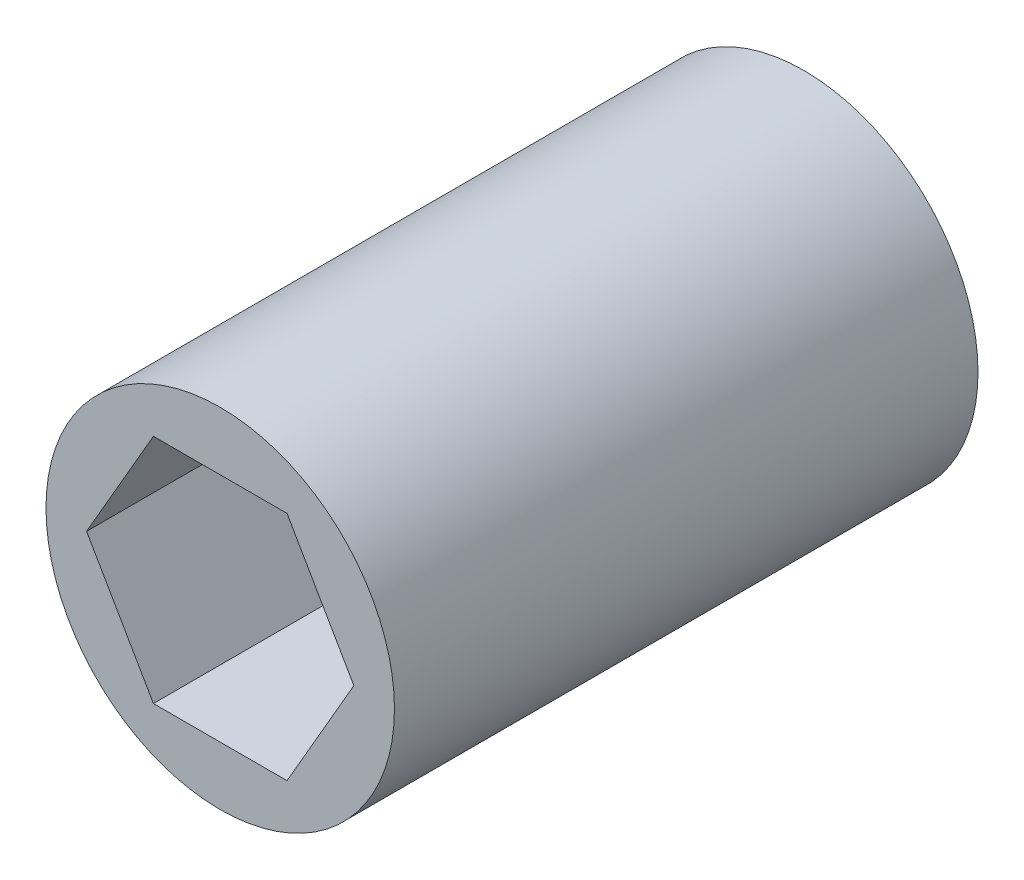
ISO-10303-21;
HEADER;
FILE_DESCRIPTION(('STEP AP214'),'2;1');
FILE_NAME('part.step','',(''),(''),'','','');
FILE_SCHEMA(('AUTOMOTIVE_DESIGN { 1 0 10303 214 1 1 1 1 }'));
ENDSEC;
DATA;
#1=APPLICATION_CONTEXT('core data for automotive mechanical design processes');
#2=APPLICATION_PROTOCOL_DEFINITION('international standard','automotive_design',2000,#1);
#3=PRODUCT_CONTEXT('',#1,'mechanical');
#4=PRODUCT('Part','Part','',(#3));
#5=PRODUCT_RELATED_PRODUCT_CATEGORY('part','',(#4));
#6=PRODUCT_DEFINITION_FORMATION('','',#4);
#7=PRODUCT_DEFINITION_CONTEXT('part definition',#1,'design');
#8=PRODUCT_DEFINITION('design','',#6,#7);
#9=PRODUCT_DEFINITION_SHAPE('','',#8);
#10=(LENGTH_UNIT() NAMED_UNIT(*) SI_UNIT(.MILLI.,.METRE.));
#11=(NAMED_UNIT(*) PLANE_ANGLE_UNIT() SI_UNIT($,.RADIAN.));
#12=(NAMED_UNIT(*) SI_UNIT($,.STERADIAN.) SOLID_ANGLE_UNIT());
#13=UNCERTAINTY_MEASURE_WITH_UNIT(LENGTH_MEASURE(1.E-05),#10,'distance_accuracy_value','');
#14=(GEOMETRIC_REPRESENTATION_CONTEXT(3) GLOBAL_UNCERTAINTY_ASSIGNED_CONTEXT((#13)) GLOBAL_UNIT_ASSIGNED_CONTEXT((#10,
#11,#12)) REPRESENTATION_CONTEXT('',''));
#15=CARTESIAN_POINT('',(0.,0.,0.));
#16=DIRECTION('',(0.,0.,1.));
#17=DIRECTION('',(1.,0.,0.));
#18=AXIS2_PLACEMENT_3D('',#15,#16,#17);
#19=CARTESIAN_POINT('',(-7.47899538708241,0.,3.175));
#20=DIRECTION('',(0.866025403784439,0.5,0.));
#21=DIRECTION('',(-0.5,0.866025403784439,0.));
#22=AXIS2_PLACEMENT_3D('',#19,#20,#21);
#23=PLANE('',#22);
#24=DIRECTION('',(0.,0.,1.));
#25=VECTOR('',#24,1.);
#26=CARTESIAN_POINT('',(-7.47899538708241,0.,3.175));
#27=LINE('',#26,#25);
#28=CARTESIAN_POINT('',(-7.47899538708241,0.,19.48815));
#29=VERTEX_POINT('',#28);
#30=CARTESIAN_POINT('',(-7.47899538708241,0.,-13.1699));
#31=VERTEX_POINT('',#30);
#32=EDGE_CURVE('E44',#29,#31,#27,.F.);
#33=ORIENTED_EDGE('',*,*,#32,.F.);
#34=DIRECTION('',(-0.5,0.866025403784439,0.));
#35=VECTOR('',#34,1.);
#36=CARTESIAN_POINT('',(-3.73949769354121,-6.477,19.48815));
#37=LINE('',#36,#35);
#38=CARTESIAN_POINT('',(-3.73949769354121,-6.477,19.48815));
#39=VERTEX_POINT('',#38);
#40=EDGE_CURVE('E122',#39,#29,#37,.T.);
#41=ORIENTED_EDGE('',*,*,#40,.F.);
#42=DIRECTION('',(0.,0.,1.));
#43=VECTOR('',#42,1.);
#44=CARTESIAN_POINT('',(-3.73949769354121,-6.477,3.175));
#45=LINE('',#44,#43);
#46=CARTESIAN_POINT('',(-3.73949769354127,-6.47699999999997,-13.1699));
#47=VERTEX_POINT('',#46);
#48=EDGE_CURVE('E49',#47,#39,#45,.T.);
#49=ORIENTED_EDGE('',*,*,#48,.F.);
#50=DIRECTION('',(-0.499999999999991,0.866025403784444,0.));
#51=VECTOR('',#50,1.);
#52=CARTESIAN_POINT('',(-3.73949769354127,-6.47699999999997,-13.1699));
#53=LINE('',#52,#51);
#54=EDGE_CURVE('E141',#47,#31,#53,.T.);
#55=ORIENTED_EDGE('',*,*,#54,.T.);
#56=EDGE_LOOP('',(#33,#41,#49,#55));
#57=FACE_BOUND('',#56,.T.);
#58=ADVANCED_FACE('F41',(#57),#23,.T.);
#59=CARTESIAN_POINT('',(-3.73949769354121,6.477,3.175));
#60=DIRECTION('',(0.866025403784439,-0.5,0.));
#61=DIRECTION('',(0.5,0.866025403784439,0.));
#62=AXIS2_PLACEMENT_3D('',#59,#60,#61);
#63=PLANE('',#62);
#64=DIRECTION('',(0.,0.,1.));
#65=VECTOR('',#64,1.);
#66=CARTESIAN_POINT('',(-3.73949769354121,6.477,3.175));
#67=LINE('',#66,#65);
#68=CARTESIAN_POINT('',(-3.73949769354121,6.477,19.48815));
#69=VERTEX_POINT('',#68);
#70=CARTESIAN_POINT('',(-3.73949769354121,6.477,-13.1699));
#71=VERTEX_POINT('',#70);
#72=EDGE_CURVE('E170',#69,#71,#67,.F.);
#73=ORIENTED_EDGE('',*,*,#72,.F.);
#74=DIRECTION('',(0.5,0.866025403784439,0.));
#75=VECTOR('',#74,1.);
#76=CARTESIAN_POINT('',(-7.47899538708241,0.,19.48815));
#77=LINE('',#76,#75);
#78=EDGE_CURVE('E128',#29,#69,#77,.T.);
#79=ORIENTED_EDGE('',*,*,#78,.F.);
#80=ORIENTED_EDGE('',*,*,#32,.T.);
#81=DIRECTION('',(0.500000000000005,0.866025403784436,0.));
#82=VECTOR('',#81,1.);
#83=CARTESIAN_POINT('',(-7.47899538708241,0.,-13.1699));
#84=LINE('',#83,#82);
#85=EDGE_CURVE('E116',#31,#71,#84,.T.);
#86=ORIENTED_EDGE('',*,*,#85,.T.);
#87=EDGE_LOOP('',(#73,#79,#80,#86));
#88=FACE_BOUND('',#87,.T.);
#89=ADVANCED_FACE('F175',(#88),#63,.T.);
#90=CARTESIAN_POINT('',(3.7394976935412,6.477,3.175));
#91=DIRECTION('',(0.,-1.,0.));
#92=DIRECTION('',(1.,0.,0.));
#93=AXIS2_PLACEMENT_3D('',#90,#91,#92);
#94=PLANE('',#93);
#95=DIRECTION('',(0.,0.,1.));
#96=VECTOR('',#95,1.);
#97=CARTESIAN_POINT('',(3.7394976935412,6.47700000000001,3.175));
#98=LINE('',#97,#96);
#99=CARTESIAN_POINT('',(3.7394976935412,6.477,19.48815));
#100=VERTEX_POINT('',#99);
#101=CARTESIAN_POINT('',(3.73949769354122,6.47699999999999,-13.1699));
#102=VERTEX_POINT('',#101);
#103=EDGE_CURVE('E103',#100,#102,#98,.F.);
#104=ORIENTED_EDGE('',*,*,#103,.F.);
#105=DIRECTION('',(1.,0.,0.));
#106=VECTOR('',#105,1.);
#107=CARTESIAN_POINT('',(-3.73949769354121,6.477,19.48815));
#108=LINE('',#107,#106);
#109=EDGE_CURVE('E115',#69,#100,#108,.T.);
#110=ORIENTED_EDGE('',*,*,#109,.F.);
#111=ORIENTED_EDGE('',*,*,#72,.T.);
#112=DIRECTION('',(1.,0.,0.));
#113=VECTOR('',#112,1.);
#114=CARTESIAN_POINT('',(-3.73949769354121,6.477,-13.1699));
#115=LINE('',#114,#113);
#116=EDGE_CURVE('E133',#71,#102,#115,.T.);
#117=ORIENTED_EDGE('',*,*,#116,.T.);
#118=EDGE_LOOP('',(#104,#110,#111,#117));
#119=FACE_BOUND('',#118,.T.);
#120=ADVANCED_FACE('F172',(#119),#94,.T.);
#121=CARTESIAN_POINT('',(7.47899538708241,0.,3.175));
#122=DIRECTION('',(-0.866025403784439,-0.5,0.));
#123=DIRECTION('',(0.5,-0.866025403784439,0.));
#124=AXIS2_PLACEMENT_3D('',#121,#122,#123);
#125=PLANE('',#124);
#126=DIRECTION('',(0.,0.,1.));
#127=VECTOR('',#126,1.);
#128=CARTESIAN_POINT('',(7.47899538708242,0.,3.175));
#129=LINE('',#128,#127);
#130=CARTESIAN_POINT('',(7.47899538708241,0.,19.48815));
#131=VERTEX_POINT('',#130);
#132=CARTESIAN_POINT('',(7.47899538708241,0.,-13.1699));
#133=VERTEX_POINT('',#132);
#134=EDGE_CURVE('E93',#131,#133,#129,.F.);
#135=ORIENTED_EDGE('',*,*,#134,.F.);
#136=DIRECTION('',(0.5,-0.866025403784439,0.));
#137=VECTOR('',#136,1.);
#138=CARTESIAN_POINT('',(3.7394976935412,6.477,19.48815));
#139=LINE('',#138,#137);
#140=EDGE_CURVE('E96',#100,#131,#139,.T.);
#141=ORIENTED_EDGE('',*,*,#140,.F.);
#142=ORIENTED_EDGE('',*,*,#103,.T.);
#143=DIRECTION('',(0.499999999999997,-0.86602540378444,0.));
#144=VECTOR('',#143,1.);
#145=CARTESIAN_POINT('',(3.73949769354122,6.47699999999999,-13.1699));
#146=LINE('',#145,#144);
#147=EDGE_CURVE('E98',#102,#133,#146,.T.);
#148=ORIENTED_EDGE('',*,*,#147,.T.);
#149=EDGE_LOOP('',(#135,#141,#142,#148));
#150=FACE_BOUND('',#149,.T.);
#151=ADVANCED_FACE('F95',(#150),#125,.T.);
#152=CARTESIAN_POINT('',(3.73949769354121,-6.477,3.175));
#153=DIRECTION('',(-0.866025403784439,0.5,0.));
#154=DIRECTION('',(-0.5,-0.866025403784439,0.));
#155=AXIS2_PLACEMENT_3D('',#152,#153,#154);
#156=PLANE('',#155);
#157=DIRECTION('',(0.,0.,1.));
#158=VECTOR('',#157,1.);
#159=CARTESIAN_POINT('',(3.73949769354121,-6.477,3.175));
#160=LINE('',#159,#158);
#161=CARTESIAN_POINT('',(3.73949769354121,-6.477,19.48815));
#162=VERTEX_POINT('',#161);
#163=CARTESIAN_POINT('',(3.73949769354116,-6.47700000000003,-13.1699));
#164=VERTEX_POINT('',#163);
#165=EDGE_CURVE('E13',#162,#164,#160,.F.);
#166=ORIENTED_EDGE('',*,*,#165,.F.);
#167=DIRECTION('',(-0.5,-0.866025403784439,0.));
#168=VECTOR('',#167,1.);
#169=CARTESIAN_POINT('',(7.47899538708242,0.,19.48815));
#170=LINE('',#169,#168);
#171=EDGE_CURVE('E111',#131,#162,#170,.T.);
#172=ORIENTED_EDGE('',*,*,#171,.F.);
#173=ORIENTED_EDGE('',*,*,#134,.T.);
#174=DIRECTION('',(-0.500000000000005,-0.866025403784436,0.));
#175=VECTOR('',#174,1.);
#176=CARTESIAN_POINT('',(7.47899538708241,0.,-13.1699));
#177=LINE('',#176,#175);
#178=EDGE_CURVE('E137',#133,#164,#177,.T.);
#179=ORIENTED_EDGE('',*,*,#178,.T.);
#180=EDGE_LOOP('',(#166,#172,#173,#179));
#181=FACE_BOUND('',#180,.T.);
#182=ADVANCED_FACE('F118',(#181),#156,.T.);
#183=CARTESIAN_POINT('',(-3.73949769354121,-6.477,3.175));
#184=DIRECTION('',(0.,1.,0.));
#185=DIRECTION('',(0.,0.,1.));
#186=AXIS2_PLACEMENT_3D('',#183,#184,#185);
#187=PLANE('',#186);
#188=ORIENTED_EDGE('',*,*,#48,.T.);
#189=DIRECTION('',(-1.,0.,0.));
#190=VECTOR('',#189,1.);
#191=CARTESIAN_POINT('',(3.73949769354121,-6.477,19.48815));
#192=LINE('',#191,#190);
#193=EDGE_CURVE('E119',#162,#39,#192,.T.);
#194=ORIENTED_EDGE('',*,*,#193,.F.);
#195=ORIENTED_EDGE('',*,*,#165,.T.);
#196=DIRECTION('',(-1.,0.,0.));
#197=VECTOR('',#196,1.);
#198=CARTESIAN_POINT('',(3.73949769354116,-6.47700000000003,-13.1699));
#199=LINE('',#198,#197);
#200=EDGE_CURVE('E139',#164,#47,#199,.T.);
#201=ORIENTED_EDGE('',*,*,#200,.T.);
#202=EDGE_LOOP('',(#188,#194,#195,#201));
#203=FACE_BOUND('',#202,.T.);
#204=ADVANCED_FACE('F181',(#203),#187,.T.);
#205=CARTESIAN_POINT('',(0.,0.,3.175));
#206=DIRECTION('',(0.,0.,-1.));
#207=DIRECTION('',(-1.,0.,0.));
#208=AXIS2_PLACEMENT_3D('',#205,#206,#207);
#209=CYLINDRICAL_SURFACE('',#208,9.75);
#210=CARTESIAN_POINT('',(0.,0.,-13.1699));
#211=DIRECTION('',(0.,0.,-1.));
#212=DIRECTION('',(-1.,0.,0.));
#213=AXIS2_PLACEMENT_3D('',#210,#211,#212);
#214=CIRCLE('',#213,9.75);
#215=CARTESIAN_POINT('',(-9.75,0.,-13.1699));
#216=VERTEX_POINT('',#215);
#217=EDGE_CURVE('E143',#216,#216,#214,.T.);
#218=ORIENTED_EDGE('',*,*,#217,.F.);
#219=EDGE_LOOP('',(#218));
#220=FACE_BOUND('',#219,.T.);
#221=CARTESIAN_POINT('',(0.,0.,19.48815));
#222=DIRECTION('',(0.,0.,-1.));
#223=DIRECTION('',(-1.,0.,0.));
#224=AXIS2_PLACEMENT_3D('',#221,#222,#223);
#225=CIRCLE('',#224,9.75);
#226=CARTESIAN_POINT('',(-9.75,0.,19.48815));
#227=VERTEX_POINT('',#226);
#228=EDGE_CURVE('E120',#227,#227,#225,.T.);
#229=ORIENTED_EDGE('',*,*,#228,.T.);
#230=EDGE_LOOP('',(#229));
#231=FACE_BOUND('',#230,.T.);
#232=ADVANCED_FACE('F187',(#220,#231),#209,.T.);
#233=CARTESIAN_POINT('',(0.,0.,-13.1699));
#234=DIRECTION('',(0.,0.,-1.));
#235=DIRECTION('',(-1.,0.,0.));
#236=AXIS2_PLACEMENT_3D('',#233,#234,#235);
#237=PLANE('',#236);
#238=ORIENTED_EDGE('',*,*,#217,.T.);
#239=EDGE_LOOP('',(#238));
#240=FACE_BOUND('',#239,.T.);
#241=ORIENTED_EDGE('',*,*,#116,.F.);
#242=ORIENTED_EDGE('',*,*,#85,.F.);
#243=ORIENTED_EDGE('',*,*,#54,.F.);
#244=ORIENTED_EDGE('',*,*,#200,.F.);
#245=ORIENTED_EDGE('',*,*,#178,.F.);
#246=ORIENTED_EDGE('',*,*,#147,.F.);
#247=EDGE_LOOP('',(#241,#242,#243,#244,#245,#246));
#248=FACE_BOUND('',#247,.T.);
#249=ADVANCED_FACE('F178',(#240,#248),#237,.T.);
#250=CARTESIAN_POINT('',(0.,0.,19.48815));
#251=DIRECTION('',(0.,0.,-1.));
#252=DIRECTION('',(-1.,0.,0.));
#253=AXIS2_PLACEMENT_3D('',#250,#251,#252);
#254=PLANE('',#253);
#255=ORIENTED_EDGE('',*,*,#171,.T.);
#256=ORIENTED_EDGE('',*,*,#193,.T.);
#257=ORIENTED_EDGE('',*,*,#40,.T.);
#258=ORIENTED_EDGE('',*,*,#78,.T.);
#259=ORIENTED_EDGE('',*,*,#109,.T.);
#260=ORIENTED_EDGE('',*,*,#140,.T.);
#261=EDGE_LOOP('',(#255,#256,#257,#258,#259,#260));
#262=FACE_BOUND('',#261,.T.);
#263=ORIENTED_EDGE('',*,*,#228,.F.);
#264=EDGE_LOOP('',(#263));
#265=FACE_BOUND('',#264,.T.);
#266=ADVANCED_FACE('F108',(#262,#265),#254,.F.);
#267=CLOSED_SHELL('',(#58,#89,#120,#151,#182,#204,#232,#249,#266));
#268=MANIFOLD_SOLID_BREP('B2',#267);
#269=ADVANCED_BREP_SHAPE_REPRESENTATION('',(#18,#268),#14);
#270=SHAPE_DEFINITION_REPRESENTATION(#9,#269);
ENDSEC;
END-ISO-10303-21;
